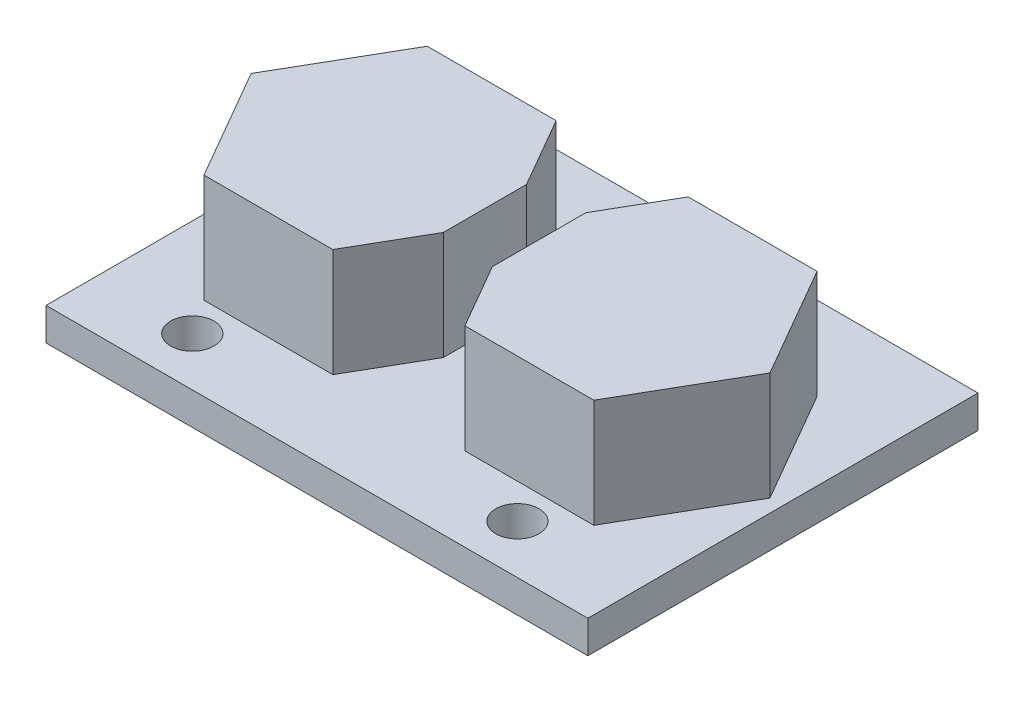
ISO-10303-21;
HEADER;
FILE_DESCRIPTION(('STEP AP214'),'2;1');
FILE_NAME('part.step','',(''),(''),'','','');
FILE_SCHEMA(('AUTOMOTIVE_DESIGN { 1 0 10303 214 1 1 1 1 }'));
ENDSEC;
DATA;
#1=APPLICATION_CONTEXT('core data for automotive mechanical design processes');
#2=APPLICATION_PROTOCOL_DEFINITION('international standard','automotive_design',2000,#1);
#3=PRODUCT_CONTEXT('',#1,'mechanical');
#4=PRODUCT('Part','Part','',(#3));
#5=PRODUCT_RELATED_PRODUCT_CATEGORY('part','',(#4));
#6=PRODUCT_DEFINITION_FORMATION('','',#4);
#7=PRODUCT_DEFINITION_CONTEXT('part definition',#1,'design');
#8=PRODUCT_DEFINITION('design','',#6,#7);
#9=PRODUCT_DEFINITION_SHAPE('','',#8);
#10=(LENGTH_UNIT() NAMED_UNIT(*) SI_UNIT(.MILLI.,.METRE.));
#11=(NAMED_UNIT(*) PLANE_ANGLE_UNIT() SI_UNIT($,.RADIAN.));
#12=(NAMED_UNIT(*) SI_UNIT($,.STERADIAN.) SOLID_ANGLE_UNIT());
#13=UNCERTAINTY_MEASURE_WITH_UNIT(LENGTH_MEASURE(1.E-05),#10,'distance_accuracy_value','');
#14=(GEOMETRIC_REPRESENTATION_CONTEXT(3) GLOBAL_UNCERTAINTY_ASSIGNED_CONTEXT((#13)) GLOBAL_UNIT_ASSIGNED_CONTEXT((#10,
#11,#12)) REPRESENTATION_CONTEXT('',''));
#15=CARTESIAN_POINT('',(0.,0.,0.));
#16=DIRECTION('',(0.,0.,1.));
#17=DIRECTION('',(1.,0.,0.));
#18=AXIS2_PLACEMENT_3D('',#15,#16,#17);
#19=CARTESIAN_POINT('',(0.,1.5,0.));
#20=DIRECTION('',(1.,0.,0.));
#21=DIRECTION('',(0.,0.,-1.));
#22=AXIS2_PLACEMENT_3D('',#19,#20,#21);
#23=PLANE('',#22);
#24=DIRECTION('',(0.,0.,1.));
#25=VECTOR('',#24,1.);
#26=CARTESIAN_POINT('',(0.,0.,0.));
#27=LINE('',#26,#25);
#28=CARTESIAN_POINT('',(0.,0.,-18.));
#29=VERTEX_POINT('',#28);
#30=CARTESIAN_POINT('',(0.,0.,0.));
#31=VERTEX_POINT('',#30);
#32=EDGE_CURVE('E282',#29,#31,#27,.T.);
#33=ORIENTED_EDGE('',*,*,#32,.T.);
#34=DIRECTION('',(0.,-1.,0.));
#35=VECTOR('',#34,1.);
#36=CARTESIAN_POINT('',(0.,1.5,0.));
#37=LINE('',#36,#35);
#38=CARTESIAN_POINT('',(0.,1.5,0.));
#39=VERTEX_POINT('',#38);
#40=EDGE_CURVE('E11',#39,#31,#37,.T.);
#41=ORIENTED_EDGE('',*,*,#40,.F.);
#42=DIRECTION('',(0.,0.,1.));
#43=VECTOR('',#42,1.);
#44=CARTESIAN_POINT('',(0.,1.5,0.));
#45=LINE('',#44,#43);
#46=CARTESIAN_POINT('',(0.,1.5,-18.));
#47=VERTEX_POINT('',#46);
#48=EDGE_CURVE('E283',#47,#39,#45,.T.);
#49=ORIENTED_EDGE('',*,*,#48,.F.);
#50=DIRECTION('',(0.,-1.,0.));
#51=VECTOR('',#50,1.);
#52=CARTESIAN_POINT('',(0.,1.5,-18.));
#53=LINE('',#52,#51);
#54=EDGE_CURVE('E293',#47,#29,#53,.T.);
#55=ORIENTED_EDGE('',*,*,#54,.T.);
#56=EDGE_LOOP('',(#33,#41,#49,#55));
#57=FACE_BOUND('',#56,.T.);
#58=ADVANCED_FACE('F37',(#57),#23,.F.);
#59=CARTESIAN_POINT('',(0.,1.5,0.));
#60=DIRECTION('',(0.,0.,-1.));
#61=DIRECTION('',(-1.,0.,0.));
#62=AXIS2_PLACEMENT_3D('',#59,#60,#61);
#63=PLANE('',#62);
#64=DIRECTION('',(1.,0.,0.));
#65=VECTOR('',#64,1.);
#66=CARTESIAN_POINT('',(0.,0.,0.));
#67=LINE('',#66,#65);
#68=CARTESIAN_POINT('',(25.,0.,0.));
#69=VERTEX_POINT('',#68);
#70=EDGE_CURVE('E296',#31,#69,#67,.T.);
#71=ORIENTED_EDGE('',*,*,#70,.T.);
#72=DIRECTION('',(0.,-1.,0.));
#73=VECTOR('',#72,1.);
#74=CARTESIAN_POINT('',(25.,1.5,0.));
#75=LINE('',#74,#73);
#76=CARTESIAN_POINT('',(25.,1.5,0.));
#77=VERTEX_POINT('',#76);
#78=EDGE_CURVE('E44',#77,#69,#75,.T.);
#79=ORIENTED_EDGE('',*,*,#78,.F.);
#80=DIRECTION('',(1.,0.,0.));
#81=VECTOR('',#80,1.);
#82=CARTESIAN_POINT('',(0.,1.5,0.));
#83=LINE('',#82,#81);
#84=EDGE_CURVE('E286',#39,#77,#83,.T.);
#85=ORIENTED_EDGE('',*,*,#84,.F.);
#86=ORIENTED_EDGE('',*,*,#40,.T.);
#87=EDGE_LOOP('',(#71,#79,#85,#86));
#88=FACE_BOUND('',#87,.T.);
#89=ADVANCED_FACE('F326',(#88),#63,.F.);
#90=CARTESIAN_POINT('',(25.,1.5,0.));
#91=DIRECTION('',(-1.,0.,0.));
#92=DIRECTION('',(0.,0.,1.));
#93=AXIS2_PLACEMENT_3D('',#90,#91,#92);
#94=PLANE('',#93);
#95=DIRECTION('',(0.,0.,-1.));
#96=VECTOR('',#95,1.);
#97=CARTESIAN_POINT('',(25.,0.,0.));
#98=LINE('',#97,#96);
#99=CARTESIAN_POINT('',(25.,0.,-18.));
#100=VERTEX_POINT('',#99);
#101=EDGE_CURVE('E298',#69,#100,#98,.T.);
#102=ORIENTED_EDGE('',*,*,#101,.T.);
#103=DIRECTION('',(0.,-1.,0.));
#104=VECTOR('',#103,1.);
#105=CARTESIAN_POINT('',(25.,1.5,-18.));
#106=LINE('',#105,#104);
#107=CARTESIAN_POINT('',(25.,1.5,-18.));
#108=VERTEX_POINT('',#107);
#109=EDGE_CURVE('E303',#108,#100,#106,.T.);
#110=ORIENTED_EDGE('',*,*,#109,.F.);
#111=DIRECTION('',(0.,0.,-1.));
#112=VECTOR('',#111,1.);
#113=CARTESIAN_POINT('',(25.,1.5,0.));
#114=LINE('',#113,#112);
#115=EDGE_CURVE('E289',#77,#108,#114,.T.);
#116=ORIENTED_EDGE('',*,*,#115,.F.);
#117=ORIENTED_EDGE('',*,*,#78,.T.);
#118=EDGE_LOOP('',(#102,#110,#116,#117));
#119=FACE_BOUND('',#118,.T.);
#120=ADVANCED_FACE('F310',(#119),#94,.F.);
#121=CARTESIAN_POINT('',(0.,1.5,-18.));
#122=DIRECTION('',(0.,0.,1.));
#123=DIRECTION('',(1.,0.,0.));
#124=AXIS2_PLACEMENT_3D('',#121,#122,#123);
#125=PLANE('',#124);
#126=DIRECTION('',(-1.,0.,0.));
#127=VECTOR('',#126,1.);
#128=CARTESIAN_POINT('',(0.,0.,-18.));
#129=LINE('',#128,#127);
#130=EDGE_CURVE('E287',#100,#29,#129,.T.);
#131=ORIENTED_EDGE('',*,*,#130,.T.);
#132=ORIENTED_EDGE('',*,*,#54,.F.);
#133=DIRECTION('',(-1.,0.,0.));
#134=VECTOR('',#133,1.);
#135=CARTESIAN_POINT('',(0.,1.5,-18.));
#136=LINE('',#135,#134);
#137=EDGE_CURVE('E291',#108,#47,#136,.T.);
#138=ORIENTED_EDGE('',*,*,#137,.F.);
#139=ORIENTED_EDGE('',*,*,#109,.T.);
#140=EDGE_LOOP('',(#131,#132,#138,#139));
#141=FACE_BOUND('',#140,.T.);
#142=ADVANCED_FACE('F319',(#141),#125,.F.);
#143=CARTESIAN_POINT('',(0.,1.5,0.));
#144=DIRECTION('',(0.,-1.,0.));
#145=DIRECTION('',(0.,0.,-1.));
#146=AXIS2_PLACEMENT_3D('',#143,#144,#145);
#147=PLANE('',#146);
#148=CARTESIAN_POINT('',(19.5,1.5,-2.25));
#149=DIRECTION('',(0.,-1.,0.));
#150=DIRECTION('',(0.,0.,-1.));
#151=AXIS2_PLACEMENT_3D('',#148,#149,#150);
#152=CIRCLE('',#151,1.);
#153=CARTESIAN_POINT('',(19.5,1.5,-3.25));
#154=VERTEX_POINT('',#153);
#155=EDGE_CURVE('E411',#154,#154,#152,.F.);
#156=ORIENTED_EDGE('',*,*,#155,.F.);
#157=EDGE_LOOP('',(#156));
#158=FACE_BOUND('',#157,.T.);
#159=CARTESIAN_POINT('',(4.5,1.5,-2.25));
#160=DIRECTION('',(0.,-1.,0.));
#161=DIRECTION('',(0.,0.,-1.));
#162=AXIS2_PLACEMENT_3D('',#159,#160,#161);
#163=CIRCLE('',#162,1.);
#164=CARTESIAN_POINT('',(4.5,1.5,-3.25));
#165=VERTEX_POINT('',#164);
#166=EDGE_CURVE('E192',#165,#165,#163,.F.);
#167=ORIENTED_EDGE('',*,*,#166,.F.);
#168=EDGE_LOOP('',(#167));
#169=FACE_BOUND('',#168,.T.);
#170=DIRECTION('',(0.,0.,1.));
#171=VECTOR('',#170,1.);
#172=CARTESIAN_POINT('',(13.75,1.5,0.));
#173=LINE('',#172,#171);
#174=CARTESIAN_POINT('',(13.75,1.5,-11.1564032554233));
#175=VERTEX_POINT('',#174);
#176=CARTESIAN_POINT('',(13.75,1.5,-6.84359674457674));
#177=VERTEX_POINT('',#176);
#178=EDGE_CURVE('E208',#175,#177,#173,.T.);
#179=ORIENTED_EDGE('',*,*,#178,.F.);
#180=DIRECTION('',(0.5,0.,-0.866025403784439));
#181=VECTOR('',#180,1.);
#182=CARTESIAN_POINT('',(5.48163568297002,1.5,3.1648238371622));
#183=LINE('',#182,#181);
#184=CARTESIAN_POINT('',(15.4783538863266,1.5,-14.15));
#185=VERTEX_POINT('',#184);
#186=EDGE_CURVE('E168',#175,#185,#183,.T.);
#187=ORIENTED_EDGE('',*,*,#186,.T.);
#188=DIRECTION('',(1.,0.,0.));
#189=VECTOR('',#188,1.);
#190=CARTESIAN_POINT('',(0.,1.5,-14.15));
#191=LINE('',#190,#189);
#192=CARTESIAN_POINT('',(21.4250616589797,1.5,-14.15));
#193=VERTEX_POINT('',#192);
#194=EDGE_CURVE('E187',#185,#193,#191,.T.);
#195=ORIENTED_EDGE('',*,*,#194,.T.);
#196=DIRECTION('',(0.5,0.,0.866025403784439));
#197=VECTOR('',#196,1.);
#198=CARTESIAN_POINT('',(22.1959259760097,1.5,-12.8148238371622));
#199=LINE('',#198,#197);
#200=CARTESIAN_POINT('',(24.3984155453063,1.5,-9.00000000000001));
#201=VERTEX_POINT('',#200);
#202=EDGE_CURVE('E51',#193,#201,#199,.T.);
#203=ORIENTED_EDGE('',*,*,#202,.T.);
#204=DIRECTION('',(-0.499999999999999,0.,0.866025403784439));
#205=VECTOR('',#204,1.);
#206=CARTESIAN_POINT('',(14.4016973419498,1.5,8.31482383716219));
#207=LINE('',#206,#205);
#208=CARTESIAN_POINT('',(21.4250616589797,1.5,-3.85));
#209=VERTEX_POINT('',#208);
#210=EDGE_CURVE('E216',#201,#209,#207,.T.);
#211=ORIENTED_EDGE('',*,*,#210,.T.);
#212=DIRECTION('',(-1.,0.,0.));
#213=VECTOR('',#212,1.);
#214=CARTESIAN_POINT('',(0.,1.5,-3.85000000000002));
#215=LINE('',#214,#213);
#216=CARTESIAN_POINT('',(15.4783538863266,1.5,-3.85000000000001));
#217=VERTEX_POINT('',#216);
#218=EDGE_CURVE('E213',#209,#217,#215,.T.);
#219=ORIENTED_EDGE('',*,*,#218,.T.);
#220=DIRECTION('',(-0.5,0.,-0.866025403784438));
#221=VECTOR('',#220,1.);
#222=CARTESIAN_POINT('',(13.27586431703,1.5,-7.66482383716221));
#223=LINE('',#222,#221);
#224=EDGE_CURVE('E210',#217,#177,#223,.T.);
#225=ORIENTED_EDGE('',*,*,#224,.T.);
#226=EDGE_LOOP('',(#179,#187,#195,#203,#211,#219,#225));
#227=FACE_BOUND('',#226,.T.);
#228=DIRECTION('',(-0.5,0.,-0.866025403784439));
#229=VECTOR('',#228,1.);
#230=CARTESIAN_POINT('',(13.1659259760097,1.5,-7.60135090637988));
#231=LINE('',#230,#229);
#232=CARTESIAN_POINT('',(11.25,1.5,-10.9198320403697));
#233=VERTEX_POINT('',#232);
#234=CARTESIAN_POINT('',(9.38506165897971,1.5,-14.15));
#235=VERTEX_POINT('',#234);
#236=EDGE_CURVE('E59',#233,#235,#231,.T.);
#237=ORIENTED_EDGE('',*,*,#236,.F.);
#238=DIRECTION('',(0.,0.,1.));
#239=VECTOR('',#238,1.);
#240=CARTESIAN_POINT('',(11.25,1.5,0.));
#241=LINE('',#240,#239);
#242=CARTESIAN_POINT('',(11.25,1.5,-7.08016795963036));
#243=VERTEX_POINT('',#242);
#244=EDGE_CURVE('E172',#233,#243,#241,.T.);
#245=ORIENTED_EDGE('',*,*,#244,.T.);
#246=DIRECTION('',(0.499999999999999,0.,-0.866025403784439));
#247=VECTOR('',#246,1.);
#248=CARTESIAN_POINT('',(5.37169734194975,1.5,3.10135090637988));
#249=LINE('',#248,#247);
#250=CARTESIAN_POINT('',(9.38506165897971,1.5,-3.85));
#251=VERTEX_POINT('',#250);
#252=EDGE_CURVE('E234',#251,#243,#249,.T.);
#253=ORIENTED_EDGE('',*,*,#252,.F.);
#254=DIRECTION('',(1.,0.,0.));
#255=VECTOR('',#254,1.);
#256=CARTESIAN_POINT('',(0.,1.5,-3.85));
#257=LINE('',#256,#255);
#258=CARTESIAN_POINT('',(3.43835388632657,1.5,-3.85));
#259=VERTEX_POINT('',#258);
#260=EDGE_CURVE('E258',#259,#251,#257,.T.);
#261=ORIENTED_EDGE('',*,*,#260,.F.);
#262=DIRECTION('',(0.5,0.,0.866025403784439));
#263=VECTOR('',#262,1.);
#264=CARTESIAN_POINT('',(4.24586431702997,1.5,-2.45135090637988));
#265=LINE('',#264,#263);
#266=CARTESIAN_POINT('',(0.465000000000004,1.5,-9.));
#267=VERTEX_POINT('',#266);
#268=EDGE_CURVE('E255',#267,#259,#265,.T.);
#269=ORIENTED_EDGE('',*,*,#268,.F.);
#270=DIRECTION('',(-0.5,0.,0.866025403784439));
#271=VECTOR('',#270,1.);
#272=CARTESIAN_POINT('',(-3.54836431702997,1.5,-2.04864909362012));
#273=LINE('',#272,#271);
#274=CARTESIAN_POINT('',(3.43835388632657,1.5,-14.15));
#275=VERTEX_POINT('',#274);
#276=EDGE_CURVE('E252',#275,#267,#273,.T.);
#277=ORIENTED_EDGE('',*,*,#276,.F.);
#278=DIRECTION('',(-1.,0.,0.));
#279=VECTOR('',#278,1.);
#280=CARTESIAN_POINT('',(0.,1.5,-14.15));
#281=LINE('',#280,#279);
#282=EDGE_CURVE('E249',#235,#275,#281,.T.);
#283=ORIENTED_EDGE('',*,*,#282,.F.);
#284=EDGE_LOOP('',(#237,#245,#253,#261,#269,#277,#283));
#285=FACE_BOUND('',#284,.T.);
#286=ORIENTED_EDGE('',*,*,#48,.T.);
#287=ORIENTED_EDGE('',*,*,#84,.T.);
#288=ORIENTED_EDGE('',*,*,#115,.T.);
#289=ORIENTED_EDGE('',*,*,#137,.T.);
#290=EDGE_LOOP('',(#286,#287,#288,#289));
#291=FACE_BOUND('',#290,.T.);
#292=ADVANCED_FACE('F325',(#158,#169,#227,#285,#291),#147,.F.);
#293=CARTESIAN_POINT('',(0.,0.,0.));
#294=DIRECTION('',(0.,-1.,0.));
#295=DIRECTION('',(0.,0.,-1.));
#296=AXIS2_PLACEMENT_3D('',#293,#294,#295);
#297=PLANE('',#296);
#298=CARTESIAN_POINT('',(19.5,0.,-2.25));
#299=DIRECTION('',(0.,-1.,0.));
#300=DIRECTION('',(0.,0.,-1.));
#301=AXIS2_PLACEMENT_3D('',#298,#299,#300);
#302=CIRCLE('',#301,1.);
#303=CARTESIAN_POINT('',(19.5,0.,-3.25));
#304=VERTEX_POINT('',#303);
#305=EDGE_CURVE('E414',#304,#304,#302,.T.);
#306=ORIENTED_EDGE('',*,*,#305,.F.);
#307=EDGE_LOOP('',(#306));
#308=FACE_BOUND('',#307,.T.);
#309=CARTESIAN_POINT('',(4.5,0.,-2.25));
#310=DIRECTION('',(0.,-1.,0.));
#311=DIRECTION('',(0.,0.,-1.));
#312=AXIS2_PLACEMENT_3D('',#309,#310,#311);
#313=CIRCLE('',#312,1.);
#314=CARTESIAN_POINT('',(4.5,0.,-3.25));
#315=VERTEX_POINT('',#314);
#316=EDGE_CURVE('E416',#315,#315,#313,.T.);
#317=ORIENTED_EDGE('',*,*,#316,.F.);
#318=EDGE_LOOP('',(#317));
#319=FACE_BOUND('',#318,.T.);
#320=ORIENTED_EDGE('',*,*,#32,.F.);
#321=ORIENTED_EDGE('',*,*,#130,.F.);
#322=ORIENTED_EDGE('',*,*,#101,.F.);
#323=ORIENTED_EDGE('',*,*,#70,.F.);
#324=EDGE_LOOP('',(#320,#321,#322,#323));
#325=FACE_BOUND('',#324,.T.);
#326=ADVANCED_FACE('F316',(#308,#319,#325),#297,.T.);
#327=CARTESIAN_POINT('',(11.25,6.5,0.));
#328=DIRECTION('',(1.,0.,0.));
#329=DIRECTION('',(0.,0.,-1.));
#330=AXIS2_PLACEMENT_3D('',#327,#328,#329);
#331=PLANE('',#330);
#332=ORIENTED_EDGE('',*,*,#244,.F.);
#333=DIRECTION('',(0.,-1.,0.));
#334=VECTOR('',#333,1.);
#335=CARTESIAN_POINT('',(11.25,6.5,-10.9198320403697));
#336=LINE('',#335,#334);
#337=CARTESIAN_POINT('',(11.25,6.5,-10.9198320403697));
#338=VERTEX_POINT('',#337);
#339=EDGE_CURVE('E280',#338,#233,#336,.T.);
#340=ORIENTED_EDGE('',*,*,#339,.F.);
#341=DIRECTION('',(0.,0.,1.));
#342=VECTOR('',#341,1.);
#343=CARTESIAN_POINT('',(11.25,6.5,0.));
#344=LINE('',#343,#342);
#345=CARTESIAN_POINT('',(11.25,6.5,-7.08016795963036));
#346=VERTEX_POINT('',#345);
#347=EDGE_CURVE('E230',#338,#346,#344,.T.);
#348=ORIENTED_EDGE('',*,*,#347,.T.);
#349=DIRECTION('',(0.,-1.,0.));
#350=VECTOR('',#349,1.);
#351=CARTESIAN_POINT('',(11.25,6.5,-7.08016795963036));
#352=LINE('',#351,#350);
#353=EDGE_CURVE('E246',#346,#243,#352,.T.);
#354=ORIENTED_EDGE('',*,*,#353,.T.);
#355=EDGE_LOOP('',(#332,#340,#348,#354));
#356=FACE_BOUND('',#355,.T.);
#357=ADVANCED_FACE('F338',(#356),#331,.T.);
#358=CARTESIAN_POINT('',(13.1659259760097,6.5,-7.60135090637988));
#359=DIRECTION('',(-0.866025403784439,0.,0.5));
#360=DIRECTION('',(0.5,0.,0.866025403784439));
#361=AXIS2_PLACEMENT_3D('',#358,#359,#360);
#362=PLANE('',#361);
#363=ORIENTED_EDGE('',*,*,#236,.T.);
#364=DIRECTION('',(0.,-1.,0.));
#365=VECTOR('',#364,1.);
#366=CARTESIAN_POINT('',(9.38506165897971,6.5,-14.15));
#367=LINE('',#366,#365);
#368=CARTESIAN_POINT('',(9.38506165897971,6.5,-14.15));
#369=VERTEX_POINT('',#368);
#370=EDGE_CURVE('E277',#369,#235,#367,.T.);
#371=ORIENTED_EDGE('',*,*,#370,.F.);
#372=DIRECTION('',(-0.5,0.,-0.866025403784439));
#373=VECTOR('',#372,1.);
#374=CARTESIAN_POINT('',(13.1659259760097,6.5,-7.60135090637988));
#375=LINE('',#374,#373);
#376=EDGE_CURVE('E233',#338,#369,#375,.T.);
#377=ORIENTED_EDGE('',*,*,#376,.F.);
#378=ORIENTED_EDGE('',*,*,#339,.T.);
#379=EDGE_LOOP('',(#363,#371,#377,#378));
#380=FACE_BOUND('',#379,.T.);
#381=ADVANCED_FACE('F345',(#380),#362,.F.);
#382=CARTESIAN_POINT('',(0.,6.5,-14.15));
#383=DIRECTION('',(0.,0.,1.));
#384=DIRECTION('',(1.,0.,0.));
#385=AXIS2_PLACEMENT_3D('',#382,#383,#384);
#386=PLANE('',#385);
#387=ORIENTED_EDGE('',*,*,#282,.T.);
#388=DIRECTION('',(0.,-1.,0.));
#389=VECTOR('',#388,1.);
#390=CARTESIAN_POINT('',(3.43835388632657,6.5,-14.15));
#391=LINE('',#390,#389);
#392=CARTESIAN_POINT('',(3.43835388632657,6.5,-14.15));
#393=VERTEX_POINT('',#392);
#394=EDGE_CURVE('E274',#393,#275,#391,.T.);
#395=ORIENTED_EDGE('',*,*,#394,.F.);
#396=DIRECTION('',(-1.,0.,0.));
#397=VECTOR('',#396,1.);
#398=CARTESIAN_POINT('',(0.,6.5,-14.15));
#399=LINE('',#398,#397);
#400=EDGE_CURVE('E236',#369,#393,#399,.T.);
#401=ORIENTED_EDGE('',*,*,#400,.F.);
#402=ORIENTED_EDGE('',*,*,#370,.T.);
#403=EDGE_LOOP('',(#387,#395,#401,#402));
#404=FACE_BOUND('',#403,.T.);
#405=ADVANCED_FACE('F349',(#404),#386,.F.);
#406=CARTESIAN_POINT('',(-3.54836431702997,6.5,-2.04864909362012));
#407=DIRECTION('',(0.866025403784439,0.,0.5));
#408=DIRECTION('',(0.5,0.,-0.866025403784439));
#409=AXIS2_PLACEMENT_3D('',#406,#407,#408);
#410=PLANE('',#409);
#411=ORIENTED_EDGE('',*,*,#276,.T.);
#412=DIRECTION('',(0.,-1.,0.));
#413=VECTOR('',#412,1.);
#414=CARTESIAN_POINT('',(0.465000000000002,6.5,-9.));
#415=LINE('',#414,#413);
#416=CARTESIAN_POINT('',(0.465000000000002,6.5,-9.));
#417=VERTEX_POINT('',#416);
#418=EDGE_CURVE('E271',#417,#267,#415,.T.);
#419=ORIENTED_EDGE('',*,*,#418,.F.);
#420=DIRECTION('',(-0.5,0.,0.866025403784439));
#421=VECTOR('',#420,1.);
#422=CARTESIAN_POINT('',(-3.54836431702997,6.5,-2.04864909362012));
#423=LINE('',#422,#421);
#424=EDGE_CURVE('E238',#393,#417,#423,.T.);
#425=ORIENTED_EDGE('',*,*,#424,.F.);
#426=ORIENTED_EDGE('',*,*,#394,.T.);
#427=EDGE_LOOP('',(#411,#419,#425,#426));
#428=FACE_BOUND('',#427,.T.);
#429=ADVANCED_FACE('F353',(#428),#410,.F.);
#430=CARTESIAN_POINT('',(4.24586431702997,6.5,-2.45135090637988));
#431=DIRECTION('',(0.866025403784439,0.,-0.5));
#432=DIRECTION('',(-0.5,0.,-0.866025403784439));
#433=AXIS2_PLACEMENT_3D('',#430,#431,#432);
#434=PLANE('',#433);
#435=ORIENTED_EDGE('',*,*,#268,.T.);
#436=DIRECTION('',(0.,-1.,0.));
#437=VECTOR('',#436,1.);
#438=CARTESIAN_POINT('',(3.43835388632657,6.5,-3.85));
#439=LINE('',#438,#437);
#440=CARTESIAN_POINT('',(3.43835388632657,6.5,-3.85));
#441=VERTEX_POINT('',#440);
#442=EDGE_CURVE('E268',#441,#259,#439,.T.);
#443=ORIENTED_EDGE('',*,*,#442,.F.);
#444=DIRECTION('',(0.5,0.,0.866025403784439));
#445=VECTOR('',#444,1.);
#446=CARTESIAN_POINT('',(4.24586431702997,6.5,-2.45135090637988));
#447=LINE('',#446,#445);
#448=EDGE_CURVE('E240',#417,#441,#447,.T.);
#449=ORIENTED_EDGE('',*,*,#448,.F.);
#450=ORIENTED_EDGE('',*,*,#418,.T.);
#451=EDGE_LOOP('',(#435,#443,#449,#450));
#452=FACE_BOUND('',#451,.T.);
#453=ADVANCED_FACE('F357',(#452),#434,.F.);
#454=CARTESIAN_POINT('',(0.,6.5,-3.85));
#455=DIRECTION('',(0.,0.,-1.));
#456=DIRECTION('',(-1.,0.,0.));
#457=AXIS2_PLACEMENT_3D('',#454,#455,#456);
#458=PLANE('',#457);
#459=ORIENTED_EDGE('',*,*,#260,.T.);
#460=DIRECTION('',(0.,-1.,0.));
#461=VECTOR('',#460,1.);
#462=CARTESIAN_POINT('',(9.38506165897971,6.5,-3.85));
#463=LINE('',#462,#461);
#464=CARTESIAN_POINT('',(9.38506165897971,6.5,-3.85));
#465=VERTEX_POINT('',#464);
#466=EDGE_CURVE('E265',#465,#251,#463,.T.);
#467=ORIENTED_EDGE('',*,*,#466,.F.);
#468=DIRECTION('',(1.,0.,0.));
#469=VECTOR('',#468,1.);
#470=CARTESIAN_POINT('',(0.,6.5,-3.85));
#471=LINE('',#470,#469);
#472=EDGE_CURVE('E242',#441,#465,#471,.T.);
#473=ORIENTED_EDGE('',*,*,#472,.F.);
#474=ORIENTED_EDGE('',*,*,#442,.T.);
#475=EDGE_LOOP('',(#459,#467,#473,#474));
#476=FACE_BOUND('',#475,.T.);
#477=ADVANCED_FACE('F361',(#476),#458,.F.);
#478=CARTESIAN_POINT('',(5.37169734194975,6.5,3.10135090637988));
#479=DIRECTION('',(-0.866025403784439,0.,-0.499999999999999));
#480=DIRECTION('',(-0.499999999999999,0.,0.866025403784439));
#481=AXIS2_PLACEMENT_3D('',#478,#479,#480);
#482=PLANE('',#481);
#483=ORIENTED_EDGE('',*,*,#252,.T.);
#484=ORIENTED_EDGE('',*,*,#353,.F.);
#485=DIRECTION('',(0.499999999999999,0.,-0.866025403784439));
#486=VECTOR('',#485,1.);
#487=CARTESIAN_POINT('',(5.37169734194975,6.5,3.10135090637988));
#488=LINE('',#487,#486);
#489=EDGE_CURVE('E244',#465,#346,#488,.T.);
#490=ORIENTED_EDGE('',*,*,#489,.F.);
#491=ORIENTED_EDGE('',*,*,#466,.T.);
#492=EDGE_LOOP('',(#483,#484,#490,#491));
#493=FACE_BOUND('',#492,.T.);
#494=ADVANCED_FACE('F365',(#493),#482,.F.);
#495=CARTESIAN_POINT('',(0.,6.5,0.));
#496=DIRECTION('',(0.,1.,0.));
#497=DIRECTION('',(0.,0.,1.));
#498=AXIS2_PLACEMENT_3D('',#495,#496,#497);
#499=PLANE('',#498);
#500=ORIENTED_EDGE('',*,*,#347,.F.);
#501=ORIENTED_EDGE('',*,*,#376,.T.);
#502=ORIENTED_EDGE('',*,*,#400,.T.);
#503=ORIENTED_EDGE('',*,*,#424,.T.);
#504=ORIENTED_EDGE('',*,*,#448,.T.);
#505=ORIENTED_EDGE('',*,*,#472,.T.);
#506=ORIENTED_EDGE('',*,*,#489,.T.);
#507=EDGE_LOOP('',(#500,#501,#502,#503,#504,#505,#506));
#508=FACE_BOUND('',#507,.T.);
#509=ADVANCED_FACE('F369',(#508),#499,.T.);
#510=CARTESIAN_POINT('',(5.48163568297002,6.5,3.1648238371622));
#511=DIRECTION('',(-0.866025403784439,0.,-0.5));
#512=DIRECTION('',(-0.5,0.,0.866025403784439));
#513=AXIS2_PLACEMENT_3D('',#510,#511,#512);
#514=PLANE('',#513);
#515=ORIENTED_EDGE('',*,*,#186,.F.);
#516=DIRECTION('',(0.,-1.,0.));
#517=VECTOR('',#516,1.);
#518=CARTESIAN_POINT('',(13.75,6.5,-11.1564032554233));
#519=LINE('',#518,#517);
#520=CARTESIAN_POINT('',(13.75,6.5,-11.1564032554233));
#521=VERTEX_POINT('',#520);
#522=EDGE_CURVE('E161',#521,#175,#519,.T.);
#523=ORIENTED_EDGE('',*,*,#522,.F.);
#524=DIRECTION('',(0.5,0.,-0.866025403784439));
#525=VECTOR('',#524,1.);
#526=CARTESIAN_POINT('',(5.48163568297002,6.5,3.1648238371622));
#527=LINE('',#526,#525);
#528=CARTESIAN_POINT('',(15.4783538863266,6.5,-14.15));
#529=VERTEX_POINT('',#528);
#530=EDGE_CURVE('E165',#521,#529,#527,.T.);
#531=ORIENTED_EDGE('',*,*,#530,.T.);
#532=DIRECTION('',(0.,-1.,0.));
#533=VECTOR('',#532,1.);
#534=CARTESIAN_POINT('',(15.4783538863266,6.5,-14.15));
#535=LINE('',#534,#533);
#536=EDGE_CURVE('E206',#529,#185,#535,.T.);
#537=ORIENTED_EDGE('',*,*,#536,.T.);
#538=EDGE_LOOP('',(#515,#523,#531,#537));
#539=FACE_BOUND('',#538,.T.);
#540=ADVANCED_FACE('F163',(#539),#514,.T.);
#541=CARTESIAN_POINT('',(13.75,6.5,0.));
#542=DIRECTION('',(1.,0.,0.));
#543=DIRECTION('',(0.,0.,-1.));
#544=AXIS2_PLACEMENT_3D('',#541,#542,#543);
#545=PLANE('',#544);
#546=ORIENTED_EDGE('',*,*,#178,.T.);
#547=DIRECTION('',(0.,-1.,0.));
#548=VECTOR('',#547,1.);
#549=CARTESIAN_POINT('',(13.75,6.5,-6.84359674457674));
#550=LINE('',#549,#548);
#551=CARTESIAN_POINT('',(13.75,6.5,-6.84359674457674));
#552=VERTEX_POINT('',#551);
#553=EDGE_CURVE('E173',#552,#177,#550,.T.);
#554=ORIENTED_EDGE('',*,*,#553,.F.);
#555=DIRECTION('',(0.,0.,1.));
#556=VECTOR('',#555,1.);
#557=CARTESIAN_POINT('',(13.75,6.5,0.));
#558=LINE('',#557,#556);
#559=EDGE_CURVE('E176',#521,#552,#558,.T.);
#560=ORIENTED_EDGE('',*,*,#559,.F.);
#561=ORIENTED_EDGE('',*,*,#522,.T.);
#562=EDGE_LOOP('',(#546,#554,#560,#561));
#563=FACE_BOUND('',#562,.T.);
#564=ADVANCED_FACE('F177',(#563),#545,.F.);
#565=CARTESIAN_POINT('',(13.27586431703,6.5,-7.66482383716221));
#566=DIRECTION('',(-0.866025403784438,0.,0.5));
#567=DIRECTION('',(0.5,0.,0.866025403784438));
#568=AXIS2_PLACEMENT_3D('',#565,#566,#567);
#569=PLANE('',#568);
#570=ORIENTED_EDGE('',*,*,#224,.F.);
#571=DIRECTION('',(0.,-1.,0.));
#572=VECTOR('',#571,1.);
#573=CARTESIAN_POINT('',(15.4783538863266,6.5,-3.85000000000001));
#574=LINE('',#573,#572);
#575=CARTESIAN_POINT('',(15.4783538863266,6.5,-3.85000000000001));
#576=VERTEX_POINT('',#575);
#577=EDGE_CURVE('E227',#576,#217,#574,.T.);
#578=ORIENTED_EDGE('',*,*,#577,.F.);
#579=DIRECTION('',(-0.5,0.,-0.866025403784438));
#580=VECTOR('',#579,1.);
#581=CARTESIAN_POINT('',(13.27586431703,6.5,-7.66482383716221));
#582=LINE('',#581,#580);
#583=EDGE_CURVE('E181',#576,#552,#582,.T.);
#584=ORIENTED_EDGE('',*,*,#583,.T.);
#585=ORIENTED_EDGE('',*,*,#553,.T.);
#586=EDGE_LOOP('',(#570,#578,#584,#585));
#587=FACE_BOUND('',#586,.T.);
#588=ADVANCED_FACE('F378',(#587),#569,.T.);
#589=CARTESIAN_POINT('',(0.,6.5,-3.85000000000002));
#590=DIRECTION('',(0.,0.,1.));
#591=DIRECTION('',(1.,0.,0.));
#592=AXIS2_PLACEMENT_3D('',#589,#590,#591);
#593=PLANE('',#592);
#594=ORIENTED_EDGE('',*,*,#218,.F.);
#595=DIRECTION('',(0.,-1.,0.));
#596=VECTOR('',#595,1.);
#597=CARTESIAN_POINT('',(21.4250616589797,6.5,-3.85));
#598=LINE('',#597,#596);
#599=CARTESIAN_POINT('',(21.4250616589797,6.5,-3.85));
#600=VERTEX_POINT('',#599);
#601=EDGE_CURVE('E225',#600,#209,#598,.T.);
#602=ORIENTED_EDGE('',*,*,#601,.F.);
#603=DIRECTION('',(-1.,0.,0.));
#604=VECTOR('',#603,1.);
#605=CARTESIAN_POINT('',(0.,6.5,-3.85000000000002));
#606=LINE('',#605,#604);
#607=EDGE_CURVE('E196',#600,#576,#606,.T.);
#608=ORIENTED_EDGE('',*,*,#607,.T.);
#609=ORIENTED_EDGE('',*,*,#577,.T.);
#610=EDGE_LOOP('',(#594,#602,#608,#609));
#611=FACE_BOUND('',#610,.T.);
#612=ADVANCED_FACE('F381',(#611),#593,.T.);
#613=CARTESIAN_POINT('',(14.4016973419498,6.5,8.31482383716219));
#614=DIRECTION('',(0.866025403784439,0.,0.499999999999999));
#615=DIRECTION('',(0.499999999999999,0.,-0.866025403784439));
#616=AXIS2_PLACEMENT_3D('',#613,#614,#615);
#617=PLANE('',#616);
#618=ORIENTED_EDGE('',*,*,#210,.F.);
#619=DIRECTION('',(0.,-1.,0.));
#620=VECTOR('',#619,1.);
#621=CARTESIAN_POINT('',(24.3984155453063,6.5,-9.00000000000001));
#622=LINE('',#621,#620);
#623=CARTESIAN_POINT('',(24.3984155453063,6.5,-9.00000000000001));
#624=VERTEX_POINT('',#623);
#625=EDGE_CURVE('E223',#624,#201,#622,.T.);
#626=ORIENTED_EDGE('',*,*,#625,.F.);
#627=DIRECTION('',(-0.499999999999999,0.,0.866025403784439));
#628=VECTOR('',#627,1.);
#629=CARTESIAN_POINT('',(14.4016973419498,6.5,8.31482383716219));
#630=LINE('',#629,#628);
#631=EDGE_CURVE('E199',#624,#600,#630,.T.);
#632=ORIENTED_EDGE('',*,*,#631,.T.);
#633=ORIENTED_EDGE('',*,*,#601,.T.);
#634=EDGE_LOOP('',(#618,#626,#632,#633));
#635=FACE_BOUND('',#634,.T.);
#636=ADVANCED_FACE('F385',(#635),#617,.T.);
#637=CARTESIAN_POINT('',(22.1959259760097,6.5,-12.8148238371622));
#638=DIRECTION('',(0.866025403784438,0.,-0.5));
#639=DIRECTION('',(-0.5,0.,-0.866025403784438));
#640=AXIS2_PLACEMENT_3D('',#637,#638,#639);
#641=PLANE('',#640);
#642=ORIENTED_EDGE('',*,*,#202,.F.);
#643=DIRECTION('',(0.,-1.,0.));
#644=VECTOR('',#643,1.);
#645=CARTESIAN_POINT('',(21.4250616589797,6.5,-14.15));
#646=LINE('',#645,#644);
#647=CARTESIAN_POINT('',(21.4250616589797,6.5,-14.15));
#648=VERTEX_POINT('',#647);
#649=EDGE_CURVE('E221',#648,#193,#646,.T.);
#650=ORIENTED_EDGE('',*,*,#649,.F.);
#651=DIRECTION('',(0.5,0.,0.866025403784439));
#652=VECTOR('',#651,1.);
#653=CARTESIAN_POINT('',(22.1959259760097,6.5,-12.8148238371622));
#654=LINE('',#653,#652);
#655=EDGE_CURVE('E202',#648,#624,#654,.T.);
#656=ORIENTED_EDGE('',*,*,#655,.T.);
#657=ORIENTED_EDGE('',*,*,#625,.T.);
#658=EDGE_LOOP('',(#642,#650,#656,#657));
#659=FACE_BOUND('',#658,.T.);
#660=ADVANCED_FACE('F389',(#659),#641,.T.);
#661=CARTESIAN_POINT('',(0.,6.5,-14.15));
#662=DIRECTION('',(0.,0.,-1.));
#663=DIRECTION('',(-1.,0.,0.));
#664=AXIS2_PLACEMENT_3D('',#661,#662,#663);
#665=PLANE('',#664);
#666=ORIENTED_EDGE('',*,*,#194,.F.);
#667=ORIENTED_EDGE('',*,*,#536,.F.);
#668=DIRECTION('',(1.,0.,0.));
#669=VECTOR('',#668,1.);
#670=CARTESIAN_POINT('',(0.,6.5,-14.15));
#671=LINE('',#670,#669);
#672=EDGE_CURVE('E186',#529,#648,#671,.T.);
#673=ORIENTED_EDGE('',*,*,#672,.T.);
#674=ORIENTED_EDGE('',*,*,#649,.T.);
#675=EDGE_LOOP('',(#666,#667,#673,#674));
#676=FACE_BOUND('',#675,.T.);
#677=ADVANCED_FACE('F393',(#676),#665,.T.);
#678=CARTESIAN_POINT('',(0.,6.5,0.));
#679=DIRECTION('',(0.,1.,0.));
#680=DIRECTION('',(0.,0.,1.));
#681=AXIS2_PLACEMENT_3D('',#678,#679,#680);
#682=PLANE('',#681);
#683=ORIENTED_EDGE('',*,*,#530,.F.);
#684=ORIENTED_EDGE('',*,*,#559,.T.);
#685=ORIENTED_EDGE('',*,*,#583,.F.);
#686=ORIENTED_EDGE('',*,*,#607,.F.);
#687=ORIENTED_EDGE('',*,*,#631,.F.);
#688=ORIENTED_EDGE('',*,*,#655,.F.);
#689=ORIENTED_EDGE('',*,*,#672,.F.);
#690=EDGE_LOOP('',(#683,#684,#685,#686,#687,#688,#689));
#691=FACE_BOUND('',#690,.T.);
#692=ADVANCED_FACE('F183',(#691),#682,.T.);
#693=CARTESIAN_POINT('',(4.5,4.32842712474619,-2.25));
#694=DIRECTION('',(0.,-1.,0.));
#695=DIRECTION('',(0.,0.,-1.));
#696=AXIS2_PLACEMENT_3D('',#693,#694,#695);
#697=CYLINDRICAL_SURFACE('',#696,1.);
#698=ORIENTED_EDGE('',*,*,#166,.T.);
#699=EDGE_LOOP('',(#698));
#700=FACE_BOUND('',#699,.T.);
#701=ORIENTED_EDGE('',*,*,#316,.T.);
#702=EDGE_LOOP('',(#701));
#703=FACE_BOUND('',#702,.T.);
#704=ADVANCED_FACE('F399',(#700,#703),#697,.F.);
#705=CARTESIAN_POINT('',(19.5,4.32842712474619,-2.25));
#706=DIRECTION('',(0.,-1.,0.));
#707=DIRECTION('',(0.,0.,-1.));
#708=AXIS2_PLACEMENT_3D('',#705,#706,#707);
#709=CYLINDRICAL_SURFACE('',#708,1.);
#710=ORIENTED_EDGE('',*,*,#155,.T.);
#711=EDGE_LOOP('',(#710));
#712=FACE_BOUND('',#711,.T.);
#713=ORIENTED_EDGE('',*,*,#305,.T.);
#714=EDGE_LOOP('',(#713));
#715=FACE_BOUND('',#714,.T.);
#716=ADVANCED_FACE('F402',(#712,#715),#709,.F.);
#717=CLOSED_SHELL('',(#58,#89,#120,#142,#292,#326,#357,#381,#405,#429,#453,#477,#494,#509,#540,
#564,#588,#612,#636,#660,#677,#692,#704,#716));
#718=MANIFOLD_SOLID_BREP('B2',#717);
#719=ADVANCED_BREP_SHAPE_REPRESENTATION('',(#18,#718),#14);
#720=SHAPE_DEFINITION_REPRESENTATION(#9,#719);
ENDSEC;
END-ISO-10303-21;
